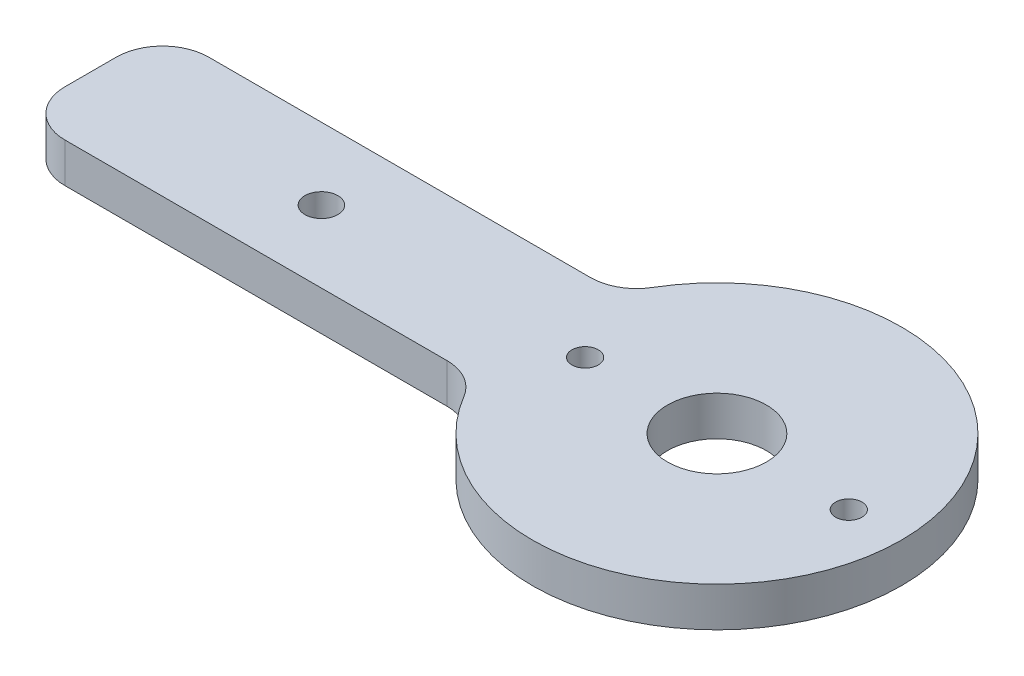
ISO-10303-21;
HEADER;
FILE_DESCRIPTION(('STEP AP214'),'2;1');
FILE_NAME('part.step','',(''),(''),'','','');
FILE_SCHEMA(('AUTOMOTIVE_DESIGN { 1 0 10303 214 1 1 1 1 }'));
ENDSEC;
DATA;
#1=APPLICATION_CONTEXT('core data for automotive mechanical design processes');
#2=APPLICATION_PROTOCOL_DEFINITION('international standard','automotive_design',2000,#1);
#3=PRODUCT_CONTEXT('',#1,'mechanical');
#4=PRODUCT('Part','Part','',(#3));
#5=PRODUCT_RELATED_PRODUCT_CATEGORY('part','',(#4));
#6=PRODUCT_DEFINITION_FORMATION('','',#4);
#7=PRODUCT_DEFINITION_CONTEXT('part definition',#1,'design');
#8=PRODUCT_DEFINITION('design','',#6,#7);
#9=PRODUCT_DEFINITION_SHAPE('','',#8);
#10=(LENGTH_UNIT() NAMED_UNIT(*) SI_UNIT(.MILLI.,.METRE.));
#11=(NAMED_UNIT(*) PLANE_ANGLE_UNIT() SI_UNIT($,.RADIAN.));
#12=(NAMED_UNIT(*) SI_UNIT($,.STERADIAN.) SOLID_ANGLE_UNIT());
#13=UNCERTAINTY_MEASURE_WITH_UNIT(LENGTH_MEASURE(1.E-05),#10,'distance_accuracy_value','');
#14=(GEOMETRIC_REPRESENTATION_CONTEXT(3) GLOBAL_UNCERTAINTY_ASSIGNED_CONTEXT((#13)) GLOBAL_UNIT_ASSIGNED_CONTEXT((#10,
#11,#12)) REPRESENTATION_CONTEXT('',''));
#15=CARTESIAN_POINT('',(0.,0.,0.));
#16=DIRECTION('',(0.,0.,1.));
#17=DIRECTION('',(1.,0.,0.));
#18=AXIS2_PLACEMENT_3D('',#15,#16,#17);
#19=CARTESIAN_POINT('',(-67.2298145714703,6.,3.89502117097387));
#20=DIRECTION('',(0.,1.,0.));
#21=DIRECTION('',(0.,0.,1.));
#22=AXIS2_PLACEMENT_3D('',#19,#20,#21);
#23=PLANE('',#22);
#24=CARTESIAN_POINT('',(20.7701854285297,6.,0.));
#25=DIRECTION('',(0.,1.,0.));
#26=DIRECTION('',(0.,0.,1.));
#27=AXIS2_PLACEMENT_3D('',#24,#25,#26);
#28=CIRCLE('',#27,7.5);
#29=CARTESIAN_POINT('',(20.7701854285297,6.,7.5));
#30=VERTEX_POINT('',#29);
#31=EDGE_CURVE('E188',#30,#30,#28,.T.);
#32=ORIENTED_EDGE('',*,*,#31,.F.);
#33=EDGE_LOOP('',(#32));
#34=FACE_BOUND('',#33,.T.);
#35=CARTESIAN_POINT('',(-39.2298145714703,6.,0.));
#36=DIRECTION('',(0.,1.,0.));
#37=DIRECTION('',(0.,0.,1.));
#38=AXIS2_PLACEMENT_3D('',#35,#36,#37);
#39=CIRCLE('',#38,2.5);
#40=CARTESIAN_POINT('',(-39.2298145714703,6.,2.5));
#41=VERTEX_POINT('',#40);
#42=EDGE_CURVE('E134',#41,#41,#39,.T.);
#43=ORIENTED_EDGE('',*,*,#42,.F.);
#44=EDGE_LOOP('',(#43));
#45=FACE_BOUND('',#44,.T.);
#46=CARTESIAN_POINT('',(-67.2298145714703,6.,3.89502117097387));
#47=DIRECTION('',(0.,1.,0.));
#48=DIRECTION('',(0.,0.,1.));
#49=AXIS2_PLACEMENT_3D('',#46,#47,#48);
#50=CIRCLE('',#49,7.);
#51=CARTESIAN_POINT('',(-74.2298145714703,6.,3.89502117097382));
#52=VERTEX_POINT('',#51);
#53=CARTESIAN_POINT('',(-67.2298145714702,6.,10.8950211709739));
#54=VERTEX_POINT('',#53);
#55=EDGE_CURVE('E145',#52,#54,#50,.T.);
#56=ORIENTED_EDGE('',*,*,#55,.T.);
#57=DIRECTION('',(1.,0.,0.));
#58=VECTOR('',#57,1.);
#59=CARTESIAN_POINT('',(-67.2298145714702,6.,10.8950211709739));
#60=LINE('',#59,#58);
#61=CARTESIAN_POINT('',(-9.30917987877684,6.,10.8950211709739));
#62=VERTEX_POINT('',#61);
#63=EDGE_CURVE('E93',#54,#62,#60,.T.);
#64=ORIENTED_EDGE('',*,*,#63,.T.);
#65=CARTESIAN_POINT('',(-9.30917987877684,6.,17.8950211709739));
#66=DIRECTION('',(0.,-1.,0.));
#67=DIRECTION('',(0.,0.,-1.));
#68=AXIS2_PLACEMENT_3D('',#65,#66,#67);
#69=CIRCLE('',#68,7.);
#70=CARTESIAN_POINT('',(-3.29330681731553,6.,14.3160169367791));
#71=VERTEX_POINT('',#70);
#72=EDGE_CURVE('E160',#62,#71,#69,.T.);
#73=ORIENTED_EDGE('',*,*,#72,.T.);
#74=CARTESIAN_POINT('',(20.7701854285297,6.,0.));
#75=DIRECTION('',(0.,1.,0.));
#76=DIRECTION('',(0.,0.,1.));
#77=AXIS2_PLACEMENT_3D('',#74,#75,#76);
#78=CIRCLE('',#77,28.);
#79=CARTESIAN_POINT('',(-3.29330681731552,6.,-14.3160169367791));
#80=VERTEX_POINT('',#79);
#81=EDGE_CURVE('E173',#71,#80,#78,.T.);
#82=ORIENTED_EDGE('',*,*,#81,.T.);
#83=CARTESIAN_POINT('',(-9.30917987877684,6.,-17.8950211709739));
#84=DIRECTION('',(0.,-1.,0.));
#85=DIRECTION('',(0.,0.,1.));
#86=AXIS2_PLACEMENT_3D('',#83,#84,#85);
#87=CIRCLE('',#86,7.);
#88=CARTESIAN_POINT('',(-9.30917987877684,6.,-10.8950211709739));
#89=VERTEX_POINT('',#88);
#90=EDGE_CURVE('E112',#80,#89,#87,.T.);
#91=ORIENTED_EDGE('',*,*,#90,.T.);
#92=DIRECTION('',(-1.,0.,0.));
#93=VECTOR('',#92,1.);
#94=CARTESIAN_POINT('',(-67.2298145714702,6.,-10.8950211709739));
#95=LINE('',#94,#93);
#96=CARTESIAN_POINT('',(-67.2298145714702,6.,-10.8950211709739));
#97=VERTEX_POINT('',#96);
#98=EDGE_CURVE('E106',#89,#97,#95,.T.);
#99=ORIENTED_EDGE('',*,*,#98,.T.);
#100=CARTESIAN_POINT('',(-67.2298145714703,6.,-3.89502117097387));
#101=DIRECTION('',(0.,1.,0.));
#102=DIRECTION('',(0.,0.,1.));
#103=AXIS2_PLACEMENT_3D('',#100,#101,#102);
#104=CIRCLE('',#103,7.);
#105=CARTESIAN_POINT('',(-74.2298145714703,6.,-3.89502117097382));
#106=VERTEX_POINT('',#105);
#107=EDGE_CURVE('E110',#97,#106,#104,.T.);
#108=ORIENTED_EDGE('',*,*,#107,.T.);
#109=DIRECTION('',(0.,0.,1.));
#110=VECTOR('',#109,1.);
#111=CARTESIAN_POINT('',(-74.2298145714703,6.,3.89502117097382));
#112=LINE('',#111,#110);
#113=EDGE_CURVE('E50',#106,#52,#112,.T.);
#114=ORIENTED_EDGE('',*,*,#113,.T.);
#115=EDGE_LOOP('',(#56,#64,#73,#82,#91,#99,#108,#114));
#116=FACE_BOUND('',#115,.T.);
#117=CARTESIAN_POINT('',(0.770185428529718,6.,0.));
#118=DIRECTION('',(0.,1.,0.));
#119=DIRECTION('',(0.,0.,1.));
#120=AXIS2_PLACEMENT_3D('',#117,#118,#119);
#121=CIRCLE('',#120,2.);
#122=CARTESIAN_POINT('',(0.770185428529718,6.,2.));
#123=VERTEX_POINT('',#122);
#124=EDGE_CURVE('E182',#123,#123,#121,.T.);
#125=ORIENTED_EDGE('',*,*,#124,.F.);
#126=EDGE_LOOP('',(#125));
#127=FACE_BOUND('',#126,.T.);
#128=CARTESIAN_POINT('',(40.7701854285297,6.,0.));
#129=DIRECTION('',(0.,1.,0.));
#130=DIRECTION('',(0.,0.,1.));
#131=AXIS2_PLACEMENT_3D('',#128,#129,#130);
#132=CIRCLE('',#131,2.);
#133=CARTESIAN_POINT('',(40.7701854285297,6.,2.));
#134=VERTEX_POINT('',#133);
#135=EDGE_CURVE('E194',#134,#134,#132,.T.);
#136=ORIENTED_EDGE('',*,*,#135,.F.);
#137=EDGE_LOOP('',(#136));
#138=FACE_BOUND('',#137,.T.);
#139=ADVANCED_FACE('F33',(#34,#45,#116,#127,#138),#23,.T.);
#140=CARTESIAN_POINT('',(-67.2298145714703,0.,3.89502117097387));
#141=DIRECTION('',(0.,1.,0.));
#142=DIRECTION('',(0.,0.,1.));
#143=AXIS2_PLACEMENT_3D('',#140,#141,#142);
#144=PLANE('',#143);
#145=CARTESIAN_POINT('',(20.7701854285297,0.,0.));
#146=DIRECTION('',(0.,1.,0.));
#147=DIRECTION('',(0.,0.,1.));
#148=AXIS2_PLACEMENT_3D('',#145,#146,#147);
#149=CIRCLE('',#148,7.5);
#150=CARTESIAN_POINT('',(20.7701854285297,0.,7.5));
#151=VERTEX_POINT('',#150);
#152=EDGE_CURVE('E191',#151,#151,#149,.T.);
#153=ORIENTED_EDGE('',*,*,#152,.T.);
#154=EDGE_LOOP('',(#153));
#155=FACE_BOUND('',#154,.T.);
#156=CARTESIAN_POINT('',(-39.2298145714703,0.,0.));
#157=DIRECTION('',(0.,1.,0.));
#158=DIRECTION('',(0.,0.,1.));
#159=AXIS2_PLACEMENT_3D('',#156,#157,#158);
#160=CIRCLE('',#159,2.5);
#161=CARTESIAN_POINT('',(-39.2298145714703,0.,2.5));
#162=VERTEX_POINT('',#161);
#163=EDGE_CURVE('E179',#162,#162,#160,.T.);
#164=ORIENTED_EDGE('',*,*,#163,.T.);
#165=EDGE_LOOP('',(#164));
#166=FACE_BOUND('',#165,.T.);
#167=CARTESIAN_POINT('',(-67.2298145714703,0.,3.89502117097387));
#168=DIRECTION('',(0.,1.,0.));
#169=DIRECTION('',(0.,0.,1.));
#170=AXIS2_PLACEMENT_3D('',#167,#168,#169);
#171=CIRCLE('',#170,7.);
#172=CARTESIAN_POINT('',(-74.2298145714703,0.,3.89502117097382));
#173=VERTEX_POINT('',#172);
#174=CARTESIAN_POINT('',(-67.2298145714702,0.,10.8950211709739));
#175=VERTEX_POINT('',#174);
#176=EDGE_CURVE('E130',#173,#175,#171,.T.);
#177=ORIENTED_EDGE('',*,*,#176,.F.);
#178=DIRECTION('',(0.,0.,1.));
#179=VECTOR('',#178,1.);
#180=CARTESIAN_POINT('',(-74.2298145714703,0.,3.89502117097382));
#181=LINE('',#180,#179);
#182=CARTESIAN_POINT('',(-74.2298145714703,0.,-3.89502117097382));
#183=VERTEX_POINT('',#182);
#184=EDGE_CURVE('E85',#183,#173,#181,.T.);
#185=ORIENTED_EDGE('',*,*,#184,.F.);
#186=CARTESIAN_POINT('',(-67.2298145714703,0.,-3.89502117097387));
#187=DIRECTION('',(0.,1.,0.));
#188=DIRECTION('',(0.,0.,1.));
#189=AXIS2_PLACEMENT_3D('',#186,#187,#188);
#190=CIRCLE('',#189,7.);
#191=CARTESIAN_POINT('',(-67.2298145714702,0.,-10.8950211709739));
#192=VERTEX_POINT('',#191);
#193=EDGE_CURVE('E79',#192,#183,#190,.T.);
#194=ORIENTED_EDGE('',*,*,#193,.F.);
#195=DIRECTION('',(-1.,0.,0.));
#196=VECTOR('',#195,1.);
#197=CARTESIAN_POINT('',(-67.2298145714702,0.,-10.8950211709739));
#198=LINE('',#197,#196);
#199=CARTESIAN_POINT('',(-9.30917987877684,0.,-10.8950211709739));
#200=VERTEX_POINT('',#199);
#201=EDGE_CURVE('E120',#200,#192,#198,.T.);
#202=ORIENTED_EDGE('',*,*,#201,.F.);
#203=CARTESIAN_POINT('',(-9.30917987877684,0.,-17.8950211709739));
#204=DIRECTION('',(0.,-1.,0.));
#205=DIRECTION('',(0.,0.,1.));
#206=AXIS2_PLACEMENT_3D('',#203,#204,#205);
#207=CIRCLE('',#206,7.);
#208=CARTESIAN_POINT('',(-3.29330681731552,0.,-14.3160169367791));
#209=VERTEX_POINT('',#208);
#210=EDGE_CURVE('E140',#209,#200,#207,.T.);
#211=ORIENTED_EDGE('',*,*,#210,.F.);
#212=CARTESIAN_POINT('',(20.7701854285297,0.,0.));
#213=DIRECTION('',(0.,1.,0.));
#214=DIRECTION('',(0.,0.,1.));
#215=AXIS2_PLACEMENT_3D('',#212,#213,#214);
#216=CIRCLE('',#215,28.);
#217=CARTESIAN_POINT('',(-3.29330681731553,0.,14.3160169367791));
#218=VERTEX_POINT('',#217);
#219=EDGE_CURVE('E138',#218,#209,#216,.T.);
#220=ORIENTED_EDGE('',*,*,#219,.F.);
#221=CARTESIAN_POINT('',(-9.30917987877684,0.,17.8950211709739));
#222=DIRECTION('',(0.,-1.,0.));
#223=DIRECTION('',(0.,0.,-1.));
#224=AXIS2_PLACEMENT_3D('',#221,#222,#223);
#225=CIRCLE('',#224,7.);
#226=CARTESIAN_POINT('',(-9.30917987877684,0.,10.8950211709739));
#227=VERTEX_POINT('',#226);
#228=EDGE_CURVE('E136',#227,#218,#225,.T.);
#229=ORIENTED_EDGE('',*,*,#228,.F.);
#230=DIRECTION('',(1.,0.,0.));
#231=VECTOR('',#230,1.);
#232=CARTESIAN_POINT('',(-67.2298145714702,0.,10.8950211709739));
#233=LINE('',#232,#231);
#234=EDGE_CURVE('E133',#175,#227,#233,.T.);
#235=ORIENTED_EDGE('',*,*,#234,.F.);
#236=EDGE_LOOP('',(#177,#185,#194,#202,#211,#220,#229,#235));
#237=FACE_BOUND('',#236,.T.);
#238=CARTESIAN_POINT('',(0.770185428529718,0.,0.));
#239=DIRECTION('',(0.,1.,0.));
#240=DIRECTION('',(0.,0.,1.));
#241=AXIS2_PLACEMENT_3D('',#238,#239,#240);
#242=CIRCLE('',#241,2.);
#243=CARTESIAN_POINT('',(0.770185428529718,0.,2.));
#244=VERTEX_POINT('',#243);
#245=EDGE_CURVE('E185',#244,#244,#242,.T.);
#246=ORIENTED_EDGE('',*,*,#245,.T.);
#247=EDGE_LOOP('',(#246));
#248=FACE_BOUND('',#247,.T.);
#249=CARTESIAN_POINT('',(40.7701854285297,0.,0.));
#250=DIRECTION('',(0.,1.,0.));
#251=DIRECTION('',(0.,0.,1.));
#252=AXIS2_PLACEMENT_3D('',#249,#250,#251);
#253=CIRCLE('',#252,2.);
#254=CARTESIAN_POINT('',(40.7701854285297,0.,2.));
#255=VERTEX_POINT('',#254);
#256=EDGE_CURVE('E197',#255,#255,#253,.T.);
#257=ORIENTED_EDGE('',*,*,#256,.T.);
#258=EDGE_LOOP('',(#257));
#259=FACE_BOUND('',#258,.T.);
#260=ADVANCED_FACE('F164',(#155,#166,#237,#248,#259),#144,.F.);
#261=CARTESIAN_POINT('',(-67.2298145714703,6.,3.89502117097387));
#262=DIRECTION('',(0.,-1.,0.));
#263=DIRECTION('',(0.,0.,-1.));
#264=AXIS2_PLACEMENT_3D('',#261,#262,#263);
#265=CYLINDRICAL_SURFACE('',#264,7.);
#266=ORIENTED_EDGE('',*,*,#176,.T.);
#267=DIRECTION('',(0.,-1.,0.));
#268=VECTOR('',#267,1.);
#269=CARTESIAN_POINT('',(-67.2298145714702,6.,10.8950211709739));
#270=LINE('',#269,#268);
#271=EDGE_CURVE('E11',#54,#175,#270,.T.);
#272=ORIENTED_EDGE('',*,*,#271,.F.);
#273=ORIENTED_EDGE('',*,*,#55,.F.);
#274=DIRECTION('',(0.,-1.,0.));
#275=VECTOR('',#274,1.);
#276=CARTESIAN_POINT('',(-74.2298145714703,6.,3.89502117097382));
#277=LINE('',#276,#275);
#278=EDGE_CURVE('E126',#52,#173,#277,.T.);
#279=ORIENTED_EDGE('',*,*,#278,.T.);
#280=EDGE_LOOP('',(#266,#272,#273,#279));
#281=FACE_BOUND('',#280,.T.);
#282=ADVANCED_FACE('F35',(#281),#265,.T.);
#283=CARTESIAN_POINT('',(-67.2298145714702,6.,10.8950211709739));
#284=DIRECTION('',(0.,0.,-1.));
#285=DIRECTION('',(-1.,0.,0.));
#286=AXIS2_PLACEMENT_3D('',#283,#284,#285);
#287=PLANE('',#286);
#288=ORIENTED_EDGE('',*,*,#234,.T.);
#289=DIRECTION('',(0.,-1.,0.));
#290=VECTOR('',#289,1.);
#291=CARTESIAN_POINT('',(-9.30917987877684,6.,10.8950211709739));
#292=LINE('',#291,#290);
#293=EDGE_CURVE('E42',#62,#227,#292,.T.);
#294=ORIENTED_EDGE('',*,*,#293,.F.);
#295=ORIENTED_EDGE('',*,*,#63,.F.);
#296=ORIENTED_EDGE('',*,*,#271,.T.);
#297=EDGE_LOOP('',(#288,#294,#295,#296));
#298=FACE_BOUND('',#297,.T.);
#299=ADVANCED_FACE('F232',(#298),#287,.F.);
#300=CARTESIAN_POINT('',(-9.30917987877684,6.,17.8950211709739));
#301=DIRECTION('',(0.,-1.,0.));
#302=DIRECTION('',(0.,0.,-1.));
#303=AXIS2_PLACEMENT_3D('',#300,#301,#302);
#304=CYLINDRICAL_SURFACE('',#303,7.);
#305=ORIENTED_EDGE('',*,*,#228,.T.);
#306=DIRECTION('',(0.,-1.,0.));
#307=VECTOR('',#306,1.);
#308=CARTESIAN_POINT('',(-3.29330681731553,6.,14.3160169367791));
#309=LINE('',#308,#307);
#310=EDGE_CURVE('E152',#71,#218,#309,.T.);
#311=ORIENTED_EDGE('',*,*,#310,.F.);
#312=ORIENTED_EDGE('',*,*,#72,.F.);
#313=ORIENTED_EDGE('',*,*,#293,.T.);
#314=EDGE_LOOP('',(#305,#311,#312,#313));
#315=FACE_BOUND('',#314,.T.);
#316=ADVANCED_FACE('F158',(#315),#304,.F.);
#317=CARTESIAN_POINT('',(20.7701854285297,6.,0.));
#318=DIRECTION('',(0.,-1.,0.));
#319=DIRECTION('',(0.,0.,-1.));
#320=AXIS2_PLACEMENT_3D('',#317,#318,#319);
#321=CYLINDRICAL_SURFACE('',#320,28.);
#322=ORIENTED_EDGE('',*,*,#219,.T.);
#323=DIRECTION('',(0.,-1.,0.));
#324=VECTOR('',#323,1.);
#325=CARTESIAN_POINT('',(-3.29330681731552,6.,-14.3160169367791));
#326=LINE('',#325,#324);
#327=EDGE_CURVE('E149',#80,#209,#326,.T.);
#328=ORIENTED_EDGE('',*,*,#327,.F.);
#329=ORIENTED_EDGE('',*,*,#81,.F.);
#330=ORIENTED_EDGE('',*,*,#310,.T.);
#331=EDGE_LOOP('',(#322,#328,#329,#330));
#332=FACE_BOUND('',#331,.T.);
#333=ADVANCED_FACE('F169',(#332),#321,.T.);
#334=CARTESIAN_POINT('',(-9.30917987877684,6.,-17.8950211709739));
#335=DIRECTION('',(0.,-1.,0.));
#336=DIRECTION('',(0.,0.,-1.));
#337=AXIS2_PLACEMENT_3D('',#334,#335,#336);
#338=CYLINDRICAL_SURFACE('',#337,7.);
#339=ORIENTED_EDGE('',*,*,#210,.T.);
#340=DIRECTION('',(0.,-1.,0.));
#341=VECTOR('',#340,1.);
#342=CARTESIAN_POINT('',(-9.30917987877684,6.,-10.8950211709739));
#343=LINE('',#342,#341);
#344=EDGE_CURVE('E121',#89,#200,#343,.T.);
#345=ORIENTED_EDGE('',*,*,#344,.F.);
#346=ORIENTED_EDGE('',*,*,#90,.F.);
#347=ORIENTED_EDGE('',*,*,#327,.T.);
#348=EDGE_LOOP('',(#339,#345,#346,#347));
#349=FACE_BOUND('',#348,.T.);
#350=ADVANCED_FACE('F172',(#349),#338,.F.);
#351=CARTESIAN_POINT('',(-67.2298145714702,6.,-10.8950211709739));
#352=DIRECTION('',(0.,0.,1.));
#353=DIRECTION('',(1.,0.,0.));
#354=AXIS2_PLACEMENT_3D('',#351,#352,#353);
#355=PLANE('',#354);
#356=ORIENTED_EDGE('',*,*,#201,.T.);
#357=DIRECTION('',(0.,-1.,0.));
#358=VECTOR('',#357,1.);
#359=CARTESIAN_POINT('',(-67.2298145714702,6.,-10.8950211709739));
#360=LINE('',#359,#358);
#361=EDGE_CURVE('E117',#97,#192,#360,.T.);
#362=ORIENTED_EDGE('',*,*,#361,.F.);
#363=ORIENTED_EDGE('',*,*,#98,.F.);
#364=ORIENTED_EDGE('',*,*,#344,.T.);
#365=EDGE_LOOP('',(#356,#362,#363,#364));
#366=FACE_BOUND('',#365,.T.);
#367=ADVANCED_FACE('F118',(#366),#355,.F.);
#368=CARTESIAN_POINT('',(-67.2298145714703,6.,-3.89502117097387));
#369=DIRECTION('',(0.,-1.,0.));
#370=DIRECTION('',(0.,0.,-1.));
#371=AXIS2_PLACEMENT_3D('',#368,#369,#370);
#372=CYLINDRICAL_SURFACE('',#371,7.);
#373=ORIENTED_EDGE('',*,*,#193,.T.);
#374=DIRECTION('',(0.,-1.,0.));
#375=VECTOR('',#374,1.);
#376=CARTESIAN_POINT('',(-74.2298145714703,6.,-3.89502117097382));
#377=LINE('',#376,#375);
#378=EDGE_CURVE('E122',#106,#183,#377,.T.);
#379=ORIENTED_EDGE('',*,*,#378,.F.);
#380=ORIENTED_EDGE('',*,*,#107,.F.);
#381=ORIENTED_EDGE('',*,*,#361,.T.);
#382=EDGE_LOOP('',(#373,#379,#380,#381));
#383=FACE_BOUND('',#382,.T.);
#384=ADVANCED_FACE('F124',(#383),#372,.T.);
#385=CARTESIAN_POINT('',(-74.2298145714703,6.,3.89502117097382));
#386=DIRECTION('',(1.,0.,0.));
#387=DIRECTION('',(0.,0.,-1.));
#388=AXIS2_PLACEMENT_3D('',#385,#386,#387);
#389=PLANE('',#388);
#390=ORIENTED_EDGE('',*,*,#184,.T.);
#391=ORIENTED_EDGE('',*,*,#278,.F.);
#392=ORIENTED_EDGE('',*,*,#113,.F.);
#393=ORIENTED_EDGE('',*,*,#378,.T.);
#394=EDGE_LOOP('',(#390,#391,#392,#393));
#395=FACE_BOUND('',#394,.T.);
#396=ADVANCED_FACE('F220',(#395),#389,.F.);
#397=CARTESIAN_POINT('',(-39.2298145714703,6.,0.));
#398=DIRECTION('',(0.,-1.,0.));
#399=DIRECTION('',(0.,0.,-1.));
#400=AXIS2_PLACEMENT_3D('',#397,#398,#399);
#401=CYLINDRICAL_SURFACE('',#400,2.5);
#402=ORIENTED_EDGE('',*,*,#42,.T.);
#403=EDGE_LOOP('',(#402));
#404=FACE_BOUND('',#403,.T.);
#405=ORIENTED_EDGE('',*,*,#163,.F.);
#406=EDGE_LOOP('',(#405));
#407=FACE_BOUND('',#406,.T.);
#408=ADVANCED_FACE('F217',(#404,#407),#401,.F.);
#409=CARTESIAN_POINT('',(0.770185428529718,6.,0.));
#410=DIRECTION('',(0.,-1.,0.));
#411=DIRECTION('',(0.,0.,-1.));
#412=AXIS2_PLACEMENT_3D('',#409,#410,#411);
#413=CYLINDRICAL_SURFACE('',#412,2.);
#414=ORIENTED_EDGE('',*,*,#124,.T.);
#415=EDGE_LOOP('',(#414));
#416=FACE_BOUND('',#415,.T.);
#417=ORIENTED_EDGE('',*,*,#245,.F.);
#418=EDGE_LOOP('',(#417));
#419=FACE_BOUND('',#418,.T.);
#420=ADVANCED_FACE('F296',(#416,#419),#413,.F.);
#421=CARTESIAN_POINT('',(20.7701854285297,6.,0.));
#422=DIRECTION('',(0.,-1.,0.));
#423=DIRECTION('',(0.,0.,-1.));
#424=AXIS2_PLACEMENT_3D('',#421,#422,#423);
#425=CYLINDRICAL_SURFACE('',#424,7.5);
#426=ORIENTED_EDGE('',*,*,#31,.T.);
#427=EDGE_LOOP('',(#426));
#428=FACE_BOUND('',#427,.T.);
#429=ORIENTED_EDGE('',*,*,#152,.F.);
#430=EDGE_LOOP('',(#429));
#431=FACE_BOUND('',#430,.T.);
#432=ADVANCED_FACE('F304',(#428,#431),#425,.F.);
#433=CARTESIAN_POINT('',(40.7701854285297,6.,0.));
#434=DIRECTION('',(0.,-1.,0.));
#435=DIRECTION('',(0.,0.,-1.));
#436=AXIS2_PLACEMENT_3D('',#433,#434,#435);
#437=CYLINDRICAL_SURFACE('',#436,2.);
#438=ORIENTED_EDGE('',*,*,#135,.T.);
#439=EDGE_LOOP('',(#438));
#440=FACE_BOUND('',#439,.T.);
#441=ORIENTED_EDGE('',*,*,#256,.F.);
#442=EDGE_LOOP('',(#441));
#443=FACE_BOUND('',#442,.T.);
#444=ADVANCED_FACE('F203',(#440,#443),#437,.F.);
#445=CLOSED_SHELL('',(#139,#260,#282,#299,#316,#333,#350,#367,#384,#396,#408,#420,#432,#444));
#446=MANIFOLD_SOLID_BREP('B2',#445);
#447=ADVANCED_BREP_SHAPE_REPRESENTATION('',(#18,#446),#14);
#448=SHAPE_DEFINITION_REPRESENTATION(#9,#447);
ENDSEC;
END-ISO-10303-21;
